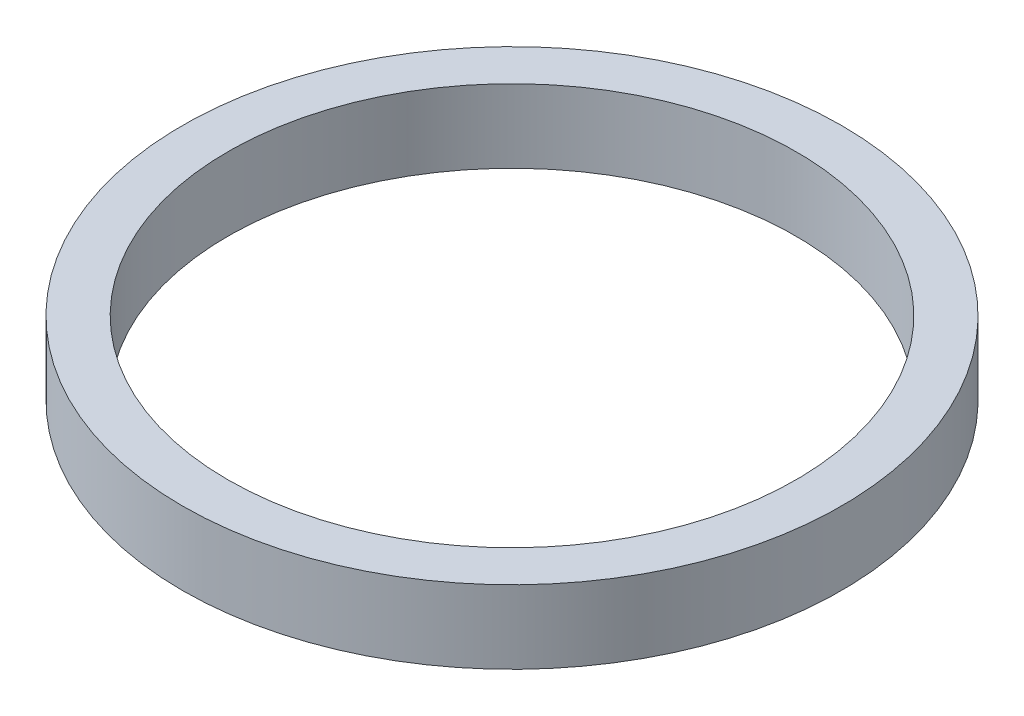
ISO-10303-21;
HEADER;
FILE_DESCRIPTION(('STEP AP214'),'2;1');
FILE_NAME('part.step','',(''),(''),'','','');
FILE_SCHEMA(('AUTOMOTIVE_DESIGN { 1 0 10303 214 1 1 1 1 }'));
ENDSEC;
DATA;
#1=APPLICATION_CONTEXT('core data for automotive mechanical design processes');
#2=APPLICATION_PROTOCOL_DEFINITION('international standard','automotive_design',2000,#1);
#3=PRODUCT_CONTEXT('',#1,'mechanical');
#4=PRODUCT('Part','Part','',(#3));
#5=PRODUCT_RELATED_PRODUCT_CATEGORY('part','',(#4));
#6=PRODUCT_DEFINITION_FORMATION('','',#4);
#7=PRODUCT_DEFINITION_CONTEXT('part definition',#1,'design');
#8=PRODUCT_DEFINITION('design','',#6,#7);
#9=PRODUCT_DEFINITION_SHAPE('','',#8);
#10=(LENGTH_UNIT() NAMED_UNIT(*) SI_UNIT(.MILLI.,.METRE.));
#11=(NAMED_UNIT(*) PLANE_ANGLE_UNIT() SI_UNIT($,.RADIAN.));
#12=(NAMED_UNIT(*) SI_UNIT($,.STERADIAN.) SOLID_ANGLE_UNIT());
#13=UNCERTAINTY_MEASURE_WITH_UNIT(LENGTH_MEASURE(1.E-05),#10,'distance_accuracy_value','');
#14=(GEOMETRIC_REPRESENTATION_CONTEXT(3) GLOBAL_UNCERTAINTY_ASSIGNED_CONTEXT((#13)) GLOBAL_UNIT_ASSIGNED_CONTEXT((#10,
#11,#12)) REPRESENTATION_CONTEXT('',''));
#15=CARTESIAN_POINT('',(0.,0.,0.));
#16=DIRECTION('',(0.,0.,1.));
#17=DIRECTION('',(1.,0.,0.));
#18=AXIS2_PLACEMENT_3D('',#15,#16,#17);
#19=CARTESIAN_POINT('',(0.,12.7,0.));
#20=DIRECTION('',(0.,-1.,0.));
#21=DIRECTION('',(0.,0.,-1.));
#22=AXIS2_PLACEMENT_3D('',#19,#20,#21);
#23=CYLINDRICAL_SURFACE('',#22,57.15);
#24=CARTESIAN_POINT('',(0.,12.7,0.));
#25=DIRECTION('',(0.,1.,0.));
#26=DIRECTION('',(0.,0.,1.));
#27=AXIS2_PLACEMENT_3D('',#24,#25,#26);
#28=CIRCLE('',#27,57.15);
#29=CARTESIAN_POINT('',(0.,12.7,57.15));
#30=VERTEX_POINT('',#29);
#31=EDGE_CURVE('E10',#30,#30,#28,.T.);
#32=ORIENTED_EDGE('',*,*,#31,.F.);
#33=EDGE_LOOP('',(#32));
#34=FACE_BOUND('',#33,.T.);
#35=CARTESIAN_POINT('',(0.,0.,0.));
#36=DIRECTION('',(0.,1.,0.));
#37=DIRECTION('',(0.,0.,1.));
#38=AXIS2_PLACEMENT_3D('',#35,#36,#37);
#39=CIRCLE('',#38,57.15);
#40=CARTESIAN_POINT('',(0.,0.,57.15));
#41=VERTEX_POINT('',#40);
#42=EDGE_CURVE('E40',#41,#41,#39,.T.);
#43=ORIENTED_EDGE('',*,*,#42,.T.);
#44=EDGE_LOOP('',(#43));
#45=FACE_BOUND('',#44,.T.);
#46=ADVANCED_FACE('F37',(#34,#45),#23,.T.);
#47=CARTESIAN_POINT('',(0.,12.7,0.));
#48=DIRECTION('',(0.,1.,0.));
#49=DIRECTION('',(0.,0.,1.));
#50=AXIS2_PLACEMENT_3D('',#47,#48,#49);
#51=PLANE('',#50);
#52=CARTESIAN_POINT('',(0.,12.7,0.));
#53=DIRECTION('',(0.,1.,0.));
#54=DIRECTION('',(0.,0.,1.));
#55=AXIS2_PLACEMENT_3D('',#52,#53,#54);
#56=CIRCLE('',#55,49.276);
#57=CARTESIAN_POINT('',(0.,12.7,49.276));
#58=VERTEX_POINT('',#57);
#59=EDGE_CURVE('E51',#58,#58,#56,.T.);
#60=ORIENTED_EDGE('',*,*,#59,.F.);
#61=EDGE_LOOP('',(#60));
#62=FACE_BOUND('',#61,.T.);
#63=ORIENTED_EDGE('',*,*,#31,.T.);
#64=EDGE_LOOP('',(#63));
#65=FACE_BOUND('',#64,.T.);
#66=ADVANCED_FACE('F68',(#62,#65),#51,.T.);
#67=CARTESIAN_POINT('',(0.,0.,0.));
#68=DIRECTION('',(0.,1.,0.));
#69=DIRECTION('',(0.,0.,1.));
#70=AXIS2_PLACEMENT_3D('',#67,#68,#69);
#71=PLANE('',#70);
#72=CARTESIAN_POINT('',(0.,0.,0.));
#73=DIRECTION('',(0.,1.,0.));
#74=DIRECTION('',(0.,0.,1.));
#75=AXIS2_PLACEMENT_3D('',#72,#73,#74);
#76=CIRCLE('',#75,49.276);
#77=CARTESIAN_POINT('',(0.,0.,49.276));
#78=VERTEX_POINT('',#77);
#79=EDGE_CURVE('E49',#78,#78,#76,.T.);
#80=ORIENTED_EDGE('',*,*,#79,.T.);
#81=EDGE_LOOP('',(#80));
#82=FACE_BOUND('',#81,.T.);
#83=ORIENTED_EDGE('',*,*,#42,.F.);
#84=EDGE_LOOP('',(#83));
#85=FACE_BOUND('',#84,.T.);
#86=ADVANCED_FACE('F59',(#82,#85),#71,.F.);
#87=CARTESIAN_POINT('',(0.,0.,0.));
#88=DIRECTION('',(0.,1.,0.));
#89=DIRECTION('',(0.,0.,1.));
#90=AXIS2_PLACEMENT_3D('',#87,#88,#89);
#91=CYLINDRICAL_SURFACE('',#90,49.276);
#92=ORIENTED_EDGE('',*,*,#79,.F.);
#93=EDGE_LOOP('',(#92));
#94=FACE_BOUND('',#93,.T.);
#95=ORIENTED_EDGE('',*,*,#59,.T.);
#96=EDGE_LOOP('',(#95));
#97=FACE_BOUND('',#96,.T.);
#98=ADVANCED_FACE('F62',(#94,#97),#91,.F.);
#99=CLOSED_SHELL('',(#46,#66,#86,#98));
#100=MANIFOLD_SOLID_BREP('B2',#99);
#101=ADVANCED_BREP_SHAPE_REPRESENTATION('',(#18,#100),#14);
#102=SHAPE_DEFINITION_REPRESENTATION(#9,#101);
ENDSEC;
END-ISO-10303-21;
